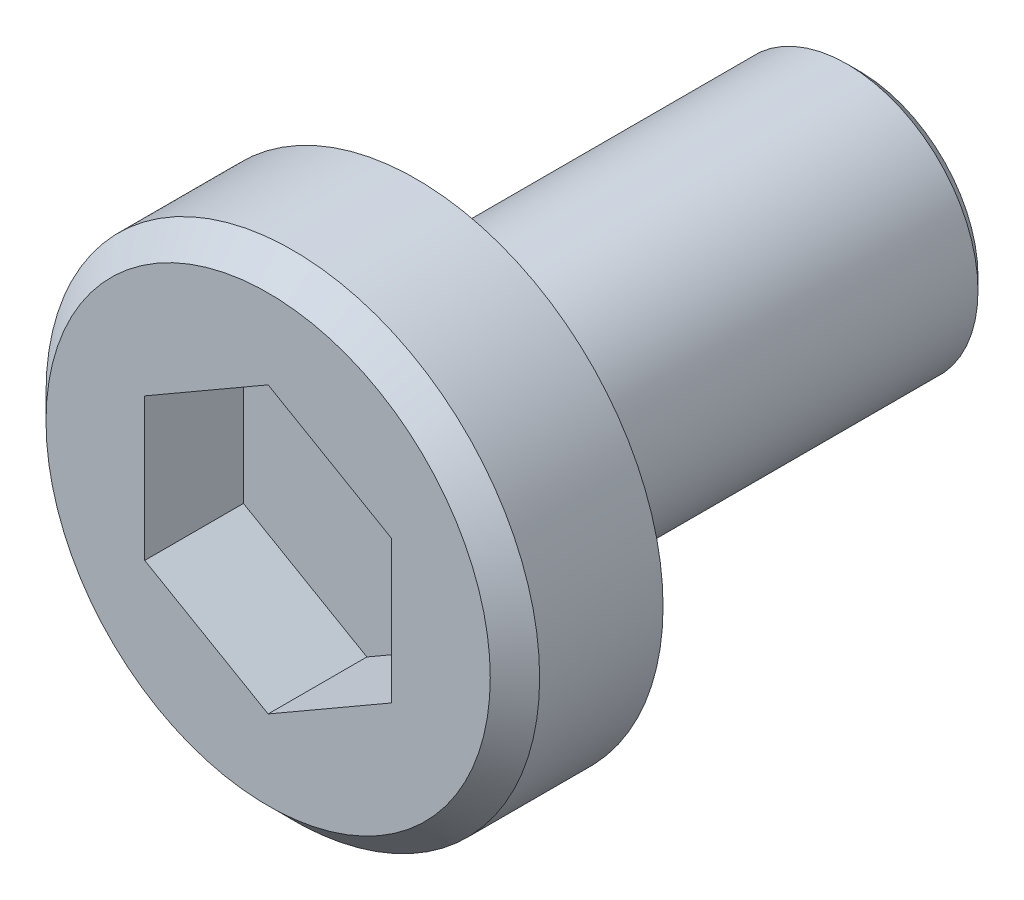
ISO-10303-21;
HEADER;
FILE_DESCRIPTION(('STEP AP214'),'2;1');
FILE_NAME('part.step','',(''),(''),'','','');
FILE_SCHEMA(('AUTOMOTIVE_DESIGN { 1 0 10303 214 1 1 1 1 }'));
ENDSEC;
DATA;
#1=APPLICATION_CONTEXT('core data for automotive mechanical design processes');
#2=APPLICATION_PROTOCOL_DEFINITION('international standard','automotive_design',2000,#1);
#3=PRODUCT_CONTEXT('',#1,'mechanical');
#4=PRODUCT('Part','Part','',(#3));
#5=PRODUCT_RELATED_PRODUCT_CATEGORY('part','',(#4));
#6=PRODUCT_DEFINITION_FORMATION('','',#4);
#7=PRODUCT_DEFINITION_CONTEXT('part definition',#1,'design');
#8=PRODUCT_DEFINITION('design','',#6,#7);
#9=PRODUCT_DEFINITION_SHAPE('','',#8);
#10=(LENGTH_UNIT() NAMED_UNIT(*) SI_UNIT(.MILLI.,.METRE.));
#11=(NAMED_UNIT(*) PLANE_ANGLE_UNIT() SI_UNIT($,.RADIAN.));
#12=(NAMED_UNIT(*) SI_UNIT($,.STERADIAN.) SOLID_ANGLE_UNIT());
#13=UNCERTAINTY_MEASURE_WITH_UNIT(LENGTH_MEASURE(1.E-05),#10,'distance_accuracy_value','');
#14=(GEOMETRIC_REPRESENTATION_CONTEXT(3) GLOBAL_UNCERTAINTY_ASSIGNED_CONTEXT((#13)) GLOBAL_UNIT_ASSIGNED_CONTEXT((#10,
#11,#12)) REPRESENTATION_CONTEXT('',''));
#15=CARTESIAN_POINT('',(0.,0.,0.));
#16=DIRECTION('',(0.,0.,1.));
#17=DIRECTION('',(1.,0.,0.));
#18=AXIS2_PLACEMENT_3D('',#15,#16,#17);
#19=CARTESIAN_POINT('',(0.,0.,0.));
#20=DIRECTION('',(0.,0.,-1.));
#21=DIRECTION('',(-1.,0.,0.));
#22=AXIS2_PLACEMENT_3D('',#19,#20,#21);
#23=PLANE('',#22);
#24=CARTESIAN_POINT('',(0.,0.,0.));
#25=DIRECTION('',(0.,0.,-1.));
#26=DIRECTION('',(-1.,0.,0.));
#27=AXIS2_PLACEMENT_3D('',#24,#25,#26);
#28=CIRCLE('',#27,4.50000000000001);
#29=CARTESIAN_POINT('',(-4.50000000000001,0.,0.));
#30=VERTEX_POINT('',#29);
#31=EDGE_CURVE('E148',#30,#30,#28,.F.);
#32=ORIENTED_EDGE('',*,*,#31,.T.);
#33=EDGE_LOOP('',(#32));
#34=FACE_BOUND('',#33,.T.);
#35=DIRECTION('',(-0.866025403784439,-0.5,0.));
#36=VECTOR('',#35,1.);
#37=CARTESIAN_POINT('',(0.,2.88675134594813,0.));
#38=LINE('',#37,#36);
#39=CARTESIAN_POINT('',(0.,2.88675134594813,0.));
#40=VERTEX_POINT('',#39);
#41=CARTESIAN_POINT('',(-2.5,1.44337567297406,0.));
#42=VERTEX_POINT('',#41);
#43=EDGE_CURVE('E124',#40,#42,#38,.T.);
#44=ORIENTED_EDGE('',*,*,#43,.F.);
#45=DIRECTION('',(-0.866025403784439,0.5,0.));
#46=VECTOR('',#45,1.);
#47=CARTESIAN_POINT('',(2.5,1.44337567297407,0.));
#48=LINE('',#47,#46);
#49=CARTESIAN_POINT('',(2.5,1.44337567297407,0.));
#50=VERTEX_POINT('',#49);
#51=EDGE_CURVE('E50',#50,#40,#48,.T.);
#52=ORIENTED_EDGE('',*,*,#51,.F.);
#53=DIRECTION('',(0.,1.,0.));
#54=VECTOR('',#53,1.);
#55=CARTESIAN_POINT('',(2.5,-1.44337567297407,0.));
#56=LINE('',#55,#54);
#57=CARTESIAN_POINT('',(2.5,-1.44337567297407,0.));
#58=VERTEX_POINT('',#57);
#59=EDGE_CURVE('E133',#58,#50,#56,.T.);
#60=ORIENTED_EDGE('',*,*,#59,.F.);
#61=DIRECTION('',(0.866025403784439,0.5,0.));
#62=VECTOR('',#61,1.);
#63=CARTESIAN_POINT('',(0.,-2.88675134594813,0.));
#64=LINE('',#63,#62);
#65=CARTESIAN_POINT('',(0.,-2.88675134594813,0.));
#66=VERTEX_POINT('',#65);
#67=EDGE_CURVE('E131',#66,#58,#64,.T.);
#68=ORIENTED_EDGE('',*,*,#67,.F.);
#69=DIRECTION('',(0.866025403784439,-0.5,0.));
#70=VECTOR('',#69,1.);
#71=CARTESIAN_POINT('',(-2.5,-1.44337567297407,0.));
#72=LINE('',#71,#70);
#73=CARTESIAN_POINT('',(-2.5,-1.44337567297407,0.));
#74=VERTEX_POINT('',#73);
#75=EDGE_CURVE('E98',#74,#66,#72,.T.);
#76=ORIENTED_EDGE('',*,*,#75,.F.);
#77=DIRECTION('',(0.,-1.,0.));
#78=VECTOR('',#77,1.);
#79=CARTESIAN_POINT('',(-2.5,1.44337567297406,0.));
#80=LINE('',#79,#78);
#81=EDGE_CURVE('E127',#42,#74,#80,.T.);
#82=ORIENTED_EDGE('',*,*,#81,.F.);
#83=EDGE_LOOP('',(#44,#52,#60,#68,#76,#82));
#84=FACE_BOUND('',#83,.T.);
#85=ADVANCED_FACE('F34',(#34,#84),#23,.F.);
#86=CARTESIAN_POINT('',(0.,0.,0.));
#87=DIRECTION('',(0.,0.,1.));
#88=DIRECTION('',(1.,0.,0.));
#89=AXIS2_PLACEMENT_3D('',#86,#87,#88);
#90=CYLINDRICAL_SURFACE('',#89,5.);
#91=CARTESIAN_POINT('',(0.,0.,-0.500000000000002));
#92=DIRECTION('',(0.,0.,-1.));
#93=DIRECTION('',(-1.,0.,0.));
#94=AXIS2_PLACEMENT_3D('',#91,#92,#93);
#95=CIRCLE('',#94,5.);
#96=CARTESIAN_POINT('',(-5.,0.,-0.500000000000002));
#97=VERTEX_POINT('',#96);
#98=EDGE_CURVE('E151',#97,#97,#95,.T.);
#99=ORIENTED_EDGE('',*,*,#98,.T.);
#100=EDGE_LOOP('',(#99));
#101=FACE_BOUND('',#100,.T.);
#102=CARTESIAN_POINT('',(0.,0.,-3.00000000000001));
#103=DIRECTION('',(0.,0.,1.));
#104=DIRECTION('',(1.,0.,0.));
#105=AXIS2_PLACEMENT_3D('',#102,#103,#104);
#106=CIRCLE('',#105,5.);
#107=CARTESIAN_POINT('',(5.,0.,-3.00000000000001));
#108=VERTEX_POINT('',#107);
#109=EDGE_CURVE('E145',#108,#108,#106,.T.);
#110=ORIENTED_EDGE('',*,*,#109,.T.);
#111=EDGE_LOOP('',(#110));
#112=FACE_BOUND('',#111,.T.);
#113=ADVANCED_FACE('F168',(#101,#112),#90,.T.);
#114=CARTESIAN_POINT('',(0.,5.,-3.00000000000001));
#115=DIRECTION('',(0.,0.,1.));
#116=DIRECTION('',(1.,0.,0.));
#117=AXIS2_PLACEMENT_3D('',#114,#115,#116);
#118=PLANE('',#117);
#119=ORIENTED_EDGE('',*,*,#109,.F.);
#120=EDGE_LOOP('',(#119));
#121=FACE_BOUND('',#120,.T.);
#122=CARTESIAN_POINT('',(0.,0.,-3.00000000000002));
#123=DIRECTION('',(0.,0.,1.));
#124=DIRECTION('',(1.,0.,0.));
#125=AXIS2_PLACEMENT_3D('',#122,#123,#124);
#126=CIRCLE('',#125,2.65);
#127=CARTESIAN_POINT('',(2.65,0.,-3.00000000000002));
#128=VERTEX_POINT('',#127);
#129=EDGE_CURVE('E137',#128,#128,#126,.T.);
#130=ORIENTED_EDGE('',*,*,#129,.T.);
#131=EDGE_LOOP('',(#130));
#132=FACE_BOUND('',#131,.T.);
#133=ADVANCED_FACE('F175',(#121,#132),#118,.F.);
#134=CARTESIAN_POINT('',(0.,0.,0.));
#135=DIRECTION('',(0.,0.,1.));
#136=DIRECTION('',(1.,0.,0.));
#137=AXIS2_PLACEMENT_3D('',#134,#135,#136);
#138=CYLINDRICAL_SURFACE('',#137,2.65);
#139=CARTESIAN_POINT('',(0.,0.,-11.73));
#140=DIRECTION('',(0.,0.,1.));
#141=DIRECTION('',(1.,0.,0.));
#142=AXIS2_PLACEMENT_3D('',#139,#140,#141);
#143=CIRCLE('',#142,2.65);
#144=CARTESIAN_POINT('',(2.65,0.,-11.73));
#145=VERTEX_POINT('',#144);
#146=EDGE_CURVE('E43',#145,#145,#143,.T.);
#147=ORIENTED_EDGE('',*,*,#146,.T.);
#148=EDGE_LOOP('',(#147));
#149=FACE_BOUND('',#148,.T.);
#150=ORIENTED_EDGE('',*,*,#129,.F.);
#151=EDGE_LOOP('',(#150));
#152=FACE_BOUND('',#151,.T.);
#153=ADVANCED_FACE('F156',(#149,#152),#138,.T.);
#154=CARTESIAN_POINT('',(0.,2.65,-11.98));
#155=DIRECTION('',(0.,0.,1.));
#156=DIRECTION('',(1.,0.,0.));
#157=AXIS2_PLACEMENT_3D('',#154,#155,#156);
#158=PLANE('',#157);
#159=CARTESIAN_POINT('',(0.,0.,-11.98));
#160=DIRECTION('',(0.,0.,1.));
#161=DIRECTION('',(1.,0.,0.));
#162=AXIS2_PLACEMENT_3D('',#159,#160,#161);
#163=CIRCLE('',#162,2.4);
#164=CARTESIAN_POINT('',(2.4,0.,-11.98));
#165=VERTEX_POINT('',#164);
#166=EDGE_CURVE('E11',#165,#165,#163,.F.);
#167=ORIENTED_EDGE('',*,*,#166,.T.);
#168=EDGE_LOOP('',(#167));
#169=FACE_BOUND('',#168,.T.);
#170=ADVANCED_FACE('F190',(#169),#158,.F.);
#171=CARTESIAN_POINT('',(2.5,1.44337567297407,-2.));
#172=DIRECTION('',(0.5,0.866025403784439,0.));
#173=DIRECTION('',(-0.866025403784439,0.5,0.));
#174=AXIS2_PLACEMENT_3D('',#171,#172,#173);
#175=PLANE('',#174);
#176=ORIENTED_EDGE('',*,*,#51,.T.);
#177=DIRECTION('',(0.,0.,1.));
#178=VECTOR('',#177,1.);
#179=CARTESIAN_POINT('',(0.,2.88675134594813,-2.));
#180=LINE('',#179,#178);
#181=CARTESIAN_POINT('',(0.,2.88675134594813,-2.));
#182=VERTEX_POINT('',#181);
#183=EDGE_CURVE('E80',#182,#40,#180,.T.);
#184=ORIENTED_EDGE('',*,*,#183,.F.);
#185=DIRECTION('',(-0.866025403784439,0.5,0.));
#186=VECTOR('',#185,1.);
#187=CARTESIAN_POINT('',(2.5,1.44337567297407,-2.));
#188=LINE('',#187,#186);
#189=CARTESIAN_POINT('',(2.5,1.44337567297407,-2.));
#190=VERTEX_POINT('',#189);
#191=EDGE_CURVE('E135',#190,#182,#188,.T.);
#192=ORIENTED_EDGE('',*,*,#191,.F.);
#193=DIRECTION('',(0.,0.,1.));
#194=VECTOR('',#193,1.);
#195=CARTESIAN_POINT('',(2.5,1.44337567297407,-2.));
#196=LINE('',#195,#194);
#197=EDGE_CURVE('E58',#190,#50,#196,.T.);
#198=ORIENTED_EDGE('',*,*,#197,.T.);
#199=EDGE_LOOP('',(#176,#184,#192,#198));
#200=FACE_BOUND('',#199,.T.);
#201=ADVANCED_FACE('F193',(#200),#175,.F.);
#202=CARTESIAN_POINT('',(2.5,-1.44337567297407,-2.));
#203=DIRECTION('',(1.,0.,0.));
#204=DIRECTION('',(0.,1.,0.));
#205=AXIS2_PLACEMENT_3D('',#202,#203,#204);
#206=PLANE('',#205);
#207=ORIENTED_EDGE('',*,*,#59,.T.);
#208=ORIENTED_EDGE('',*,*,#197,.F.);
#209=DIRECTION('',(0.,1.,0.));
#210=VECTOR('',#209,1.);
#211=CARTESIAN_POINT('',(2.5,-1.44337567297407,-2.));
#212=LINE('',#211,#210);
#213=CARTESIAN_POINT('',(2.5,-1.44337567297407,-2.));
#214=VERTEX_POINT('',#213);
#215=EDGE_CURVE('E110',#214,#190,#212,.T.);
#216=ORIENTED_EDGE('',*,*,#215,.F.);
#217=DIRECTION('',(0.,0.,1.));
#218=VECTOR('',#217,1.);
#219=CARTESIAN_POINT('',(2.5,-1.44337567297407,-2.));
#220=LINE('',#219,#218);
#221=EDGE_CURVE('E102',#214,#58,#220,.T.);
#222=ORIENTED_EDGE('',*,*,#221,.T.);
#223=EDGE_LOOP('',(#207,#208,#216,#222));
#224=FACE_BOUND('',#223,.T.);
#225=ADVANCED_FACE('F197',(#224),#206,.F.);
#226=CARTESIAN_POINT('',(0.,-2.88675134594813,-2.));
#227=DIRECTION('',(0.5,-0.866025403784439,0.));
#228=DIRECTION('',(0.866025403784439,0.5,0.));
#229=AXIS2_PLACEMENT_3D('',#226,#227,#228);
#230=PLANE('',#229);
#231=ORIENTED_EDGE('',*,*,#67,.T.);
#232=ORIENTED_EDGE('',*,*,#221,.F.);
#233=DIRECTION('',(0.866025403784439,0.5,0.));
#234=VECTOR('',#233,1.);
#235=CARTESIAN_POINT('',(0.,-2.88675134594813,-2.));
#236=LINE('',#235,#234);
#237=CARTESIAN_POINT('',(0.,-2.88675134594813,-2.));
#238=VERTEX_POINT('',#237);
#239=EDGE_CURVE('E106',#238,#214,#236,.T.);
#240=ORIENTED_EDGE('',*,*,#239,.F.);
#241=DIRECTION('',(0.,0.,1.));
#242=VECTOR('',#241,1.);
#243=CARTESIAN_POINT('',(0.,-2.88675134594813,-2.));
#244=LINE('',#243,#242);
#245=EDGE_CURVE('E91',#238,#66,#244,.T.);
#246=ORIENTED_EDGE('',*,*,#245,.T.);
#247=EDGE_LOOP('',(#231,#232,#240,#246));
#248=FACE_BOUND('',#247,.T.);
#249=ADVANCED_FACE('F107',(#248),#230,.F.);
#250=CARTESIAN_POINT('',(-2.5,-1.44337567297407,-2.));
#251=DIRECTION('',(-0.5,-0.866025403784439,0.));
#252=DIRECTION('',(0.866025403784439,-0.5,0.));
#253=AXIS2_PLACEMENT_3D('',#250,#251,#252);
#254=PLANE('',#253);
#255=ORIENTED_EDGE('',*,*,#75,.T.);
#256=ORIENTED_EDGE('',*,*,#245,.F.);
#257=DIRECTION('',(0.866025403784439,-0.5,0.));
#258=VECTOR('',#257,1.);
#259=CARTESIAN_POINT('',(-2.5,-1.44337567297407,-2.));
#260=LINE('',#259,#258);
#261=CARTESIAN_POINT('',(-2.5,-1.44337567297407,-2.));
#262=VERTEX_POINT('',#261);
#263=EDGE_CURVE('E95',#262,#238,#260,.T.);
#264=ORIENTED_EDGE('',*,*,#263,.F.);
#265=DIRECTION('',(0.,0.,1.));
#266=VECTOR('',#265,1.);
#267=CARTESIAN_POINT('',(-2.5,-1.44337567297407,-2.));
#268=LINE('',#267,#266);
#269=EDGE_CURVE('E103',#262,#74,#268,.T.);
#270=ORIENTED_EDGE('',*,*,#269,.T.);
#271=EDGE_LOOP('',(#255,#256,#264,#270));
#272=FACE_BOUND('',#271,.T.);
#273=ADVANCED_FACE('F93',(#272),#254,.F.);
#274=CARTESIAN_POINT('',(-2.5,1.44337567297406,-2.));
#275=DIRECTION('',(-1.,0.,0.));
#276=DIRECTION('',(0.,-1.,0.));
#277=AXIS2_PLACEMENT_3D('',#274,#275,#276);
#278=PLANE('',#277);
#279=ORIENTED_EDGE('',*,*,#81,.T.);
#280=ORIENTED_EDGE('',*,*,#269,.F.);
#281=DIRECTION('',(0.,-1.,0.));
#282=VECTOR('',#281,1.);
#283=CARTESIAN_POINT('',(-2.5,1.44337567297406,-2.));
#284=LINE('',#283,#282);
#285=CARTESIAN_POINT('',(-2.5,1.44337567297406,-2.));
#286=VERTEX_POINT('',#285);
#287=EDGE_CURVE('E116',#286,#262,#284,.T.);
#288=ORIENTED_EDGE('',*,*,#287,.F.);
#289=DIRECTION('',(0.,0.,1.));
#290=VECTOR('',#289,1.);
#291=CARTESIAN_POINT('',(-2.5,1.44337567297406,-2.));
#292=LINE('',#291,#290);
#293=EDGE_CURVE('E140',#286,#42,#292,.T.);
#294=ORIENTED_EDGE('',*,*,#293,.T.);
#295=EDGE_LOOP('',(#279,#280,#288,#294));
#296=FACE_BOUND('',#295,.T.);
#297=ADVANCED_FACE('F201',(#296),#278,.F.);
#298=CARTESIAN_POINT('',(0.,2.88675134594813,-2.));
#299=DIRECTION('',(-0.5,0.866025403784439,0.));
#300=DIRECTION('',(-0.866025403784439,-0.5,0.));
#301=AXIS2_PLACEMENT_3D('',#298,#299,#300);
#302=PLANE('',#301);
#303=ORIENTED_EDGE('',*,*,#43,.T.);
#304=ORIENTED_EDGE('',*,*,#293,.F.);
#305=DIRECTION('',(-0.866025403784439,-0.5,0.));
#306=VECTOR('',#305,1.);
#307=CARTESIAN_POINT('',(0.,2.88675134594813,-2.));
#308=LINE('',#307,#306);
#309=EDGE_CURVE('E118',#182,#286,#308,.T.);
#310=ORIENTED_EDGE('',*,*,#309,.F.);
#311=ORIENTED_EDGE('',*,*,#183,.T.);
#312=EDGE_LOOP('',(#303,#304,#310,#311));
#313=FACE_BOUND('',#312,.T.);
#314=ADVANCED_FACE('F198',(#313),#302,.F.);
#315=CARTESIAN_POINT('',(0.,0.,-2.));
#316=DIRECTION('',(0.,0.,1.));
#317=DIRECTION('',(1.,0.,0.));
#318=AXIS2_PLACEMENT_3D('',#315,#316,#317);
#319=PLANE('',#318);
#320=ORIENTED_EDGE('',*,*,#191,.T.);
#321=ORIENTED_EDGE('',*,*,#309,.T.);
#322=ORIENTED_EDGE('',*,*,#287,.T.);
#323=ORIENTED_EDGE('',*,*,#263,.T.);
#324=ORIENTED_EDGE('',*,*,#239,.T.);
#325=ORIENTED_EDGE('',*,*,#215,.T.);
#326=EDGE_LOOP('',(#320,#321,#322,#323,#324,#325));
#327=FACE_BOUND('',#326,.T.);
#328=ADVANCED_FACE('F113',(#327),#319,.T.);
#329=CARTESIAN_POINT('',(0.,0.,0.));
#330=DIRECTION('',(0.,0.,-1.));
#331=DIRECTION('',(-1.,0.,0.));
#332=AXIS2_PLACEMENT_3D('',#329,#330,#331);
#333=CONICAL_SURFACE('',#332,4.50000000000001,0.785398163397445);
#334=ORIENTED_EDGE('',*,*,#98,.F.);
#335=EDGE_LOOP('',(#334));
#336=FACE_BOUND('',#335,.T.);
#337=ORIENTED_EDGE('',*,*,#31,.F.);
#338=EDGE_LOOP('',(#337));
#339=FACE_BOUND('',#338,.T.);
#340=ADVANCED_FACE('F160',(#336,#339),#333,.T.);
#341=CARTESIAN_POINT('',(0.,0.,-11.73));
#342=DIRECTION('',(0.,0.,1.));
#343=DIRECTION('',(1.,0.,0.));
#344=AXIS2_PLACEMENT_3D('',#341,#342,#343);
#345=CONICAL_SURFACE('',#344,2.65,0.785398163397452);
#346=ORIENTED_EDGE('',*,*,#166,.F.);
#347=EDGE_LOOP('',(#346));
#348=FACE_BOUND('',#347,.T.);
#349=ORIENTED_EDGE('',*,*,#146,.F.);
#350=EDGE_LOOP('',(#349));
#351=FACE_BOUND('',#350,.T.);
#352=ADVANCED_FACE('F37',(#348,#351),#345,.T.);
#353=CLOSED_SHELL('',(#85,#113,#133,#153,#170,#201,#225,#249,#273,#297,#314,#328,#340,#352));
#354=MANIFOLD_SOLID_BREP('B2',#353);
#355=ADVANCED_BREP_SHAPE_REPRESENTATION('',(#18,#354),#14);
#356=SHAPE_DEFINITION_REPRESENTATION(#9,#355);
ENDSEC;
END-ISO-10303-21;
